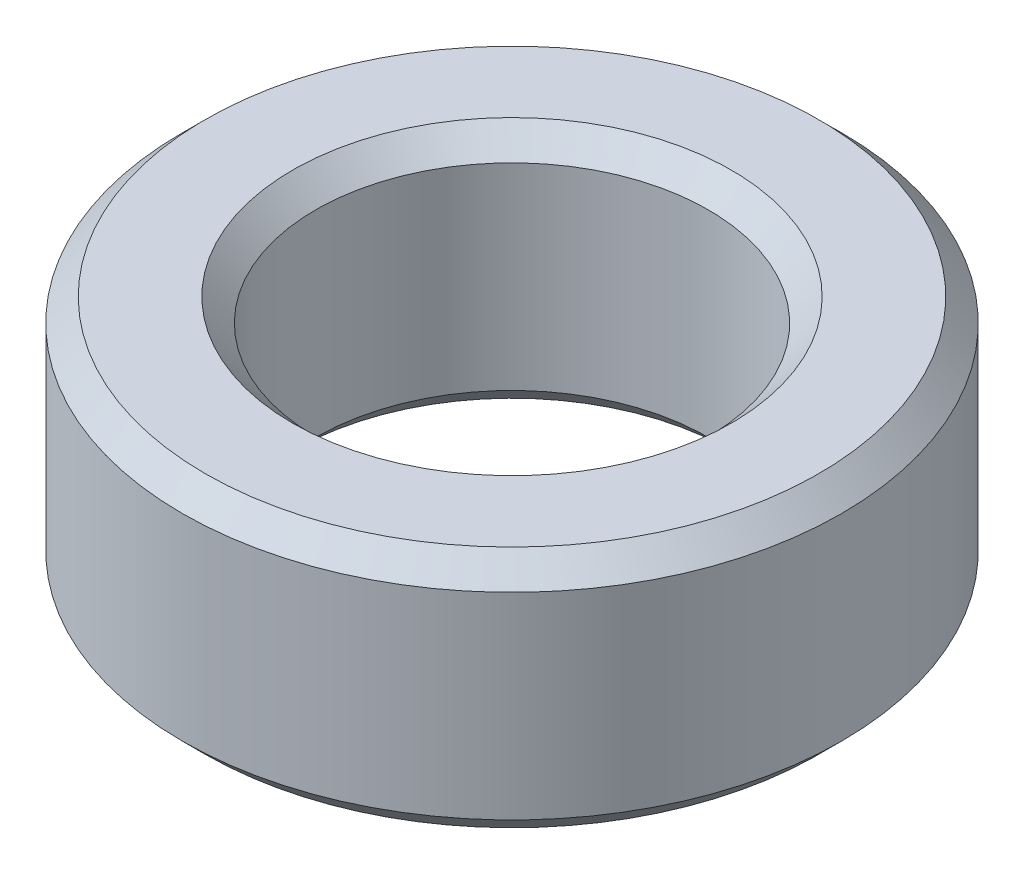
ISO-10303-21;
HEADER;
FILE_DESCRIPTION(('STEP AP214'),'2;1');
FILE_NAME('part.step','',(''),(''),'','','');
FILE_SCHEMA(('AUTOMOTIVE_DESIGN { 1 0 10303 214 1 1 1 1 }'));
ENDSEC;
DATA;
#1=APPLICATION_CONTEXT('core data for automotive mechanical design processes');
#2=APPLICATION_PROTOCOL_DEFINITION('international standard','automotive_design',2000,#1);
#3=PRODUCT_CONTEXT('',#1,'mechanical');
#4=PRODUCT('Part','Part','',(#3));
#5=PRODUCT_RELATED_PRODUCT_CATEGORY('part','',(#4));
#6=PRODUCT_DEFINITION_FORMATION('','',#4);
#7=PRODUCT_DEFINITION_CONTEXT('part definition',#1,'design');
#8=PRODUCT_DEFINITION('design','',#6,#7);
#9=PRODUCT_DEFINITION_SHAPE('','',#8);
#10=(LENGTH_UNIT() NAMED_UNIT(*) SI_UNIT(.MILLI.,.METRE.));
#11=(NAMED_UNIT(*) PLANE_ANGLE_UNIT() SI_UNIT($,.RADIAN.));
#12=(NAMED_UNIT(*) SI_UNIT($,.STERADIAN.) SOLID_ANGLE_UNIT());
#13=UNCERTAINTY_MEASURE_WITH_UNIT(LENGTH_MEASURE(1.E-05),#10,'distance_accuracy_value','');
#14=(GEOMETRIC_REPRESENTATION_CONTEXT(3) GLOBAL_UNCERTAINTY_ASSIGNED_CONTEXT((#13)) GLOBAL_UNIT_ASSIGNED_CONTEXT((#10,
#11,#12)) REPRESENTATION_CONTEXT('',''));
#15=CARTESIAN_POINT('',(0.,0.,0.));
#16=DIRECTION('',(0.,0.,1.));
#17=DIRECTION('',(1.,0.,0.));
#18=AXIS2_PLACEMENT_3D('',#15,#16,#17);
#19=CARTESIAN_POINT('',(0.,23.9601552025545,0.));
#20=DIRECTION('',(0.,-1.,0.));
#21=DIRECTION('',(0.,0.,-1.));
#22=AXIS2_PLACEMENT_3D('',#19,#20,#21);
#23=CYLINDRICAL_SURFACE('',#22,32.5);
#24=CARTESIAN_POINT('',(0.,2.26461138933651,0.));
#25=DIRECTION('',(0.,1.,0.));
#26=DIRECTION('',(0.,0.,1.));
#27=AXIS2_PLACEMENT_3D('',#24,#25,#26);
#28=CIRCLE('',#27,32.5);
#29=CARTESIAN_POINT('',(0.,2.26461138933651,32.5));
#30=VERTEX_POINT('',#29);
#31=EDGE_CURVE('E10',#30,#30,#28,.T.);
#32=ORIENTED_EDGE('',*,*,#31,.T.);
#33=EDGE_LOOP('',(#32));
#34=FACE_BOUND('',#33,.T.);
#35=CARTESIAN_POINT('',(0.,21.695543813218,0.));
#36=DIRECTION('',(0.,1.,0.));
#37=DIRECTION('',(0.,0.,1.));
#38=AXIS2_PLACEMENT_3D('',#35,#36,#37);
#39=CIRCLE('',#38,32.5);
#40=CARTESIAN_POINT('',(0.,21.695543813218,32.5));
#41=VERTEX_POINT('',#40);
#42=EDGE_CURVE('E50',#41,#41,#39,.F.);
#43=ORIENTED_EDGE('',*,*,#42,.T.);
#44=EDGE_LOOP('',(#43));
#45=FACE_BOUND('',#44,.T.);
#46=ADVANCED_FACE('F39',(#34,#45),#23,.T.);
#47=CARTESIAN_POINT('',(0.,23.9601552025545,0.));
#48=DIRECTION('',(0.,1.,0.));
#49=DIRECTION('',(0.,0.,1.));
#50=AXIS2_PLACEMENT_3D('',#47,#48,#49);
#51=PLANE('',#50);
#52=CARTESIAN_POINT('',(0.,23.9601552025545,0.));
#53=DIRECTION('',(0.,1.,0.));
#54=DIRECTION('',(0.,0.,1.));
#55=AXIS2_PLACEMENT_3D('',#52,#53,#54);
#56=CIRCLE('',#55,21.6193924384499);
#57=CARTESIAN_POINT('',(0.,23.9601552025545,21.6193924384499));
#58=VERTEX_POINT('',#57);
#59=EDGE_CURVE('E58',#58,#58,#56,.F.);
#60=ORIENTED_EDGE('',*,*,#59,.T.);
#61=EDGE_LOOP('',(#60));
#62=FACE_BOUND('',#61,.T.);
#63=CARTESIAN_POINT('',(0.,23.9601552025545,0.));
#64=DIRECTION('',(0.,1.,0.));
#65=DIRECTION('',(0.,0.,1.));
#66=AXIS2_PLACEMENT_3D('',#63,#64,#65);
#67=CIRCLE('',#66,30.2353886106635);
#68=CARTESIAN_POINT('',(0.,23.9601552025545,30.2353886106635));
#69=VERTEX_POINT('',#68);
#70=EDGE_CURVE('E61',#69,#69,#67,.T.);
#71=ORIENTED_EDGE('',*,*,#70,.T.);
#72=EDGE_LOOP('',(#71));
#73=FACE_BOUND('',#72,.T.);
#74=ADVANCED_FACE('F88',(#62,#73),#51,.T.);
#75=CARTESIAN_POINT('',(0.,0.,0.));
#76=DIRECTION('',(0.,1.,0.));
#77=DIRECTION('',(0.,0.,1.));
#78=AXIS2_PLACEMENT_3D('',#75,#76,#77);
#79=PLANE('',#78);
#80=CARTESIAN_POINT('',(0.,0.,0.));
#81=DIRECTION('',(0.,1.,0.));
#82=DIRECTION('',(0.,0.,1.));
#83=AXIS2_PLACEMENT_3D('',#80,#81,#82);
#84=CIRCLE('',#83,21.6193924384499);
#85=CARTESIAN_POINT('',(0.,0.,21.6193924384499));
#86=VERTEX_POINT('',#85);
#87=EDGE_CURVE('E51',#86,#86,#84,.T.);
#88=ORIENTED_EDGE('',*,*,#87,.T.);
#89=EDGE_LOOP('',(#88));
#90=FACE_BOUND('',#89,.T.);
#91=CARTESIAN_POINT('',(0.,0.,0.));
#92=DIRECTION('',(0.,1.,0.));
#93=DIRECTION('',(0.,0.,1.));
#94=AXIS2_PLACEMENT_3D('',#91,#92,#93);
#95=CIRCLE('',#94,30.2353886106635);
#96=CARTESIAN_POINT('',(0.,0.,30.2353886106635));
#97=VERTEX_POINT('',#96);
#98=EDGE_CURVE('E54',#97,#97,#95,.F.);
#99=ORIENTED_EDGE('',*,*,#98,.T.);
#100=EDGE_LOOP('',(#99));
#101=FACE_BOUND('',#100,.T.);
#102=ADVANCED_FACE('F83',(#90,#101),#79,.F.);
#103=CARTESIAN_POINT('',(0.,23.9601552025545,0.));
#104=DIRECTION('',(0.,-1.,0.));
#105=DIRECTION('',(0.,0.,-1.));
#106=AXIS2_PLACEMENT_3D('',#103,#104,#105);
#107=CYLINDRICAL_SURFACE('',#106,19.3547810491134);
#108=CARTESIAN_POINT('',(0.,21.695543813218,0.));
#109=DIRECTION('',(0.,1.,0.));
#110=DIRECTION('',(0.,0.,1.));
#111=AXIS2_PLACEMENT_3D('',#108,#109,#110);
#112=CIRCLE('',#111,19.3547810491134);
#113=CARTESIAN_POINT('',(0.,21.695543813218,19.3547810491134));
#114=VERTEX_POINT('',#113);
#115=EDGE_CURVE('E67',#114,#114,#112,.T.);
#116=ORIENTED_EDGE('',*,*,#115,.T.);
#117=EDGE_LOOP('',(#116));
#118=FACE_BOUND('',#117,.T.);
#119=CARTESIAN_POINT('',(0.,2.26461138933649,0.));
#120=DIRECTION('',(0.,1.,0.));
#121=DIRECTION('',(0.,0.,1.));
#122=AXIS2_PLACEMENT_3D('',#119,#120,#121);
#123=CIRCLE('',#122,19.3547810491134);
#124=CARTESIAN_POINT('',(0.,2.26461138933649,19.3547810491134));
#125=VERTEX_POINT('',#124);
#126=EDGE_CURVE('E69',#125,#125,#123,.F.);
#127=ORIENTED_EDGE('',*,*,#126,.T.);
#128=EDGE_LOOP('',(#127));
#129=FACE_BOUND('',#128,.T.);
#130=ADVANCED_FACE('F71',(#118,#129),#107,.F.);
#131=CARTESIAN_POINT('',(0.,21.695543813218,0.));
#132=DIRECTION('',(0.,1.,0.));
#133=DIRECTION('',(0.,0.,1.));
#134=AXIS2_PLACEMENT_3D('',#131,#132,#133);
#135=CONICAL_SURFACE('',#134,19.3547810491134,0.785398163397452);
#136=ORIENTED_EDGE('',*,*,#59,.F.);
#137=EDGE_LOOP('',(#136));
#138=FACE_BOUND('',#137,.T.);
#139=ORIENTED_EDGE('',*,*,#115,.F.);
#140=EDGE_LOOP('',(#139));
#141=FACE_BOUND('',#140,.T.);
#142=ADVANCED_FACE('F77',(#138,#141),#135,.F.);
#143=CARTESIAN_POINT('',(0.,0.,0.));
#144=DIRECTION('',(0.,-1.,0.));
#145=DIRECTION('',(0.,0.,-1.));
#146=AXIS2_PLACEMENT_3D('',#143,#144,#145);
#147=CONICAL_SURFACE('',#146,21.6193924384499,0.785398163397448);
#148=ORIENTED_EDGE('',*,*,#126,.F.);
#149=EDGE_LOOP('',(#148));
#150=FACE_BOUND('',#149,.T.);
#151=ORIENTED_EDGE('',*,*,#87,.F.);
#152=EDGE_LOOP('',(#151));
#153=FACE_BOUND('',#152,.T.);
#154=ADVANCED_FACE('F73',(#150,#153),#147,.F.);
#155=CARTESIAN_POINT('',(0.,2.26461138933651,0.));
#156=DIRECTION('',(0.,1.,0.));
#157=DIRECTION('',(0.,0.,1.));
#158=AXIS2_PLACEMENT_3D('',#155,#156,#157);
#159=CONICAL_SURFACE('',#158,32.5,0.785398163397454);
#160=ORIENTED_EDGE('',*,*,#98,.F.);
#161=EDGE_LOOP('',(#160));
#162=FACE_BOUND('',#161,.T.);
#163=ORIENTED_EDGE('',*,*,#31,.F.);
#164=EDGE_LOOP('',(#163));
#165=FACE_BOUND('',#164,.T.);
#166=ADVANCED_FACE('F76',(#162,#165),#159,.T.);
#167=CARTESIAN_POINT('',(0.,23.9601552025545,0.));
#168=DIRECTION('',(0.,-1.,0.));
#169=DIRECTION('',(0.,0.,-1.));
#170=AXIS2_PLACEMENT_3D('',#167,#168,#169);
#171=CONICAL_SURFACE('',#170,30.2353886106635,0.785398163397447);
#172=ORIENTED_EDGE('',*,*,#42,.F.);
#173=EDGE_LOOP('',(#172));
#174=FACE_BOUND('',#173,.T.);
#175=ORIENTED_EDGE('',*,*,#70,.F.);
#176=EDGE_LOOP('',(#175));
#177=FACE_BOUND('',#176,.T.);
#178=ADVANCED_FACE('F45',(#174,#177),#171,.T.);
#179=CLOSED_SHELL('',(#46,#74,#102,#130,#142,#154,#166,#178));
#180=MANIFOLD_SOLID_BREP('B2',#179);
#181=ADVANCED_BREP_SHAPE_REPRESENTATION('',(#18,#180),#14);
#182=SHAPE_DEFINITION_REPRESENTATION(#9,#181);
ENDSEC;
END-ISO-10303-21;
